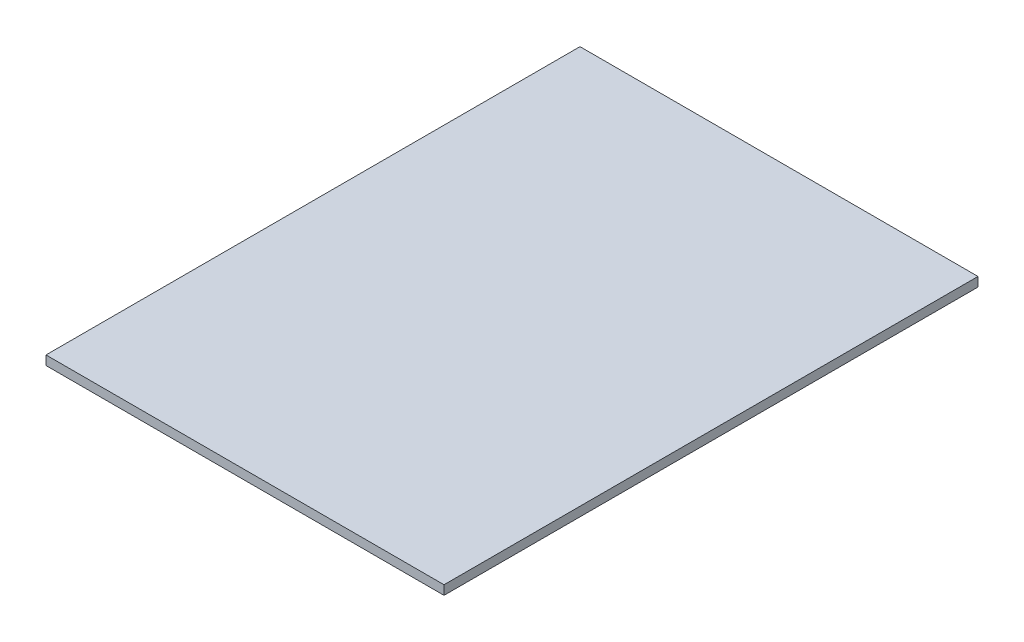
ISO-10303-21;
HEADER;
FILE_DESCRIPTION(('STEP AP214'),'2;1');
FILE_NAME('part.step','',(''),(''),'','','');
FILE_SCHEMA(('AUTOMOTIVE_DESIGN { 1 0 10303 214 1 1 1 1 }'));
ENDSEC;
DATA;
#1=APPLICATION_CONTEXT('core data for automotive mechanical design processes');
#2=APPLICATION_PROTOCOL_DEFINITION('international standard','automotive_design',2000,#1);
#3=PRODUCT_CONTEXT('',#1,'mechanical');
#4=PRODUCT('Part','Part','',(#3));
#5=PRODUCT_RELATED_PRODUCT_CATEGORY('part','',(#4));
#6=PRODUCT_DEFINITION_FORMATION('','',#4);
#7=PRODUCT_DEFINITION_CONTEXT('part definition',#1,'design');
#8=PRODUCT_DEFINITION('design','',#6,#7);
#9=PRODUCT_DEFINITION_SHAPE('','',#8);
#10=(LENGTH_UNIT() NAMED_UNIT(*) SI_UNIT(.MILLI.,.METRE.));
#11=(NAMED_UNIT(*) PLANE_ANGLE_UNIT() SI_UNIT($,.RADIAN.));
#12=(NAMED_UNIT(*) SI_UNIT($,.STERADIAN.) SOLID_ANGLE_UNIT());
#13=UNCERTAINTY_MEASURE_WITH_UNIT(LENGTH_MEASURE(1.E-05),#10,'distance_accuracy_value','');
#14=(GEOMETRIC_REPRESENTATION_CONTEXT(3) GLOBAL_UNCERTAINTY_ASSIGNED_CONTEXT((#13)) GLOBAL_UNIT_ASSIGNED_CONTEXT((#10,
#11,#12)) REPRESENTATION_CONTEXT('',''));
#15=CARTESIAN_POINT('',(0.,0.,0.));
#16=DIRECTION('',(0.,0.,1.));
#17=DIRECTION('',(1.,0.,0.));
#18=AXIS2_PLACEMENT_3D('',#15,#16,#17);
#19=CARTESIAN_POINT('',(0.,2.032,0.));
#20=DIRECTION('',(1.,0.,0.));
#21=DIRECTION('',(0.,0.,-1.));
#22=AXIS2_PLACEMENT_3D('',#19,#20,#21);
#23=PLANE('',#22);
#24=DIRECTION('',(0.,0.,1.));
#25=VECTOR('',#24,1.);
#26=CARTESIAN_POINT('',(0.,0.,0.));
#27=LINE('',#26,#25);
#28=CARTESIAN_POINT('',(0.,0.,-117.828));
#29=VERTEX_POINT('',#28);
#30=CARTESIAN_POINT('',(0.,0.,0.));
#31=VERTEX_POINT('',#30);
#32=EDGE_CURVE('E96',#29,#31,#27,.T.);
#33=ORIENTED_EDGE('',*,*,#32,.T.);
#34=DIRECTION('',(0.,-1.,0.));
#35=VECTOR('',#34,1.);
#36=CARTESIAN_POINT('',(0.,2.032,0.));
#37=LINE('',#36,#35);
#38=CARTESIAN_POINT('',(0.,2.032,0.));
#39=VERTEX_POINT('',#38);
#40=EDGE_CURVE('E11',#39,#31,#37,.T.);
#41=ORIENTED_EDGE('',*,*,#40,.F.);
#42=DIRECTION('',(0.,0.,1.));
#43=VECTOR('',#42,1.);
#44=CARTESIAN_POINT('',(0.,2.032,0.));
#45=LINE('',#44,#43);
#46=CARTESIAN_POINT('',(0.,2.032,-117.828));
#47=VERTEX_POINT('',#46);
#48=EDGE_CURVE('E84',#47,#39,#45,.T.);
#49=ORIENTED_EDGE('',*,*,#48,.F.);
#50=DIRECTION('',(0.,-1.,0.));
#51=VECTOR('',#50,1.);
#52=CARTESIAN_POINT('',(0.,2.032,-117.828));
#53=LINE('',#52,#51);
#54=EDGE_CURVE('E92',#47,#29,#53,.T.);
#55=ORIENTED_EDGE('',*,*,#54,.T.);
#56=EDGE_LOOP('',(#33,#41,#49,#55));
#57=FACE_BOUND('',#56,.T.);
#58=ADVANCED_FACE('F33',(#57),#23,.F.);
#59=CARTESIAN_POINT('',(0.,2.032,0.));
#60=DIRECTION('',(0.,0.,-1.));
#61=DIRECTION('',(-1.,0.,0.));
#62=AXIS2_PLACEMENT_3D('',#59,#60,#61);
#63=PLANE('',#62);
#64=DIRECTION('',(1.,0.,0.));
#65=VECTOR('',#64,1.);
#66=CARTESIAN_POINT('',(0.,0.,0.));
#67=LINE('',#66,#65);
#68=CARTESIAN_POINT('',(87.828,0.,0.));
#69=VERTEX_POINT('',#68);
#70=EDGE_CURVE('E88',#31,#69,#67,.T.);
#71=ORIENTED_EDGE('',*,*,#70,.T.);
#72=DIRECTION('',(0.,-1.,0.));
#73=VECTOR('',#72,1.);
#74=CARTESIAN_POINT('',(87.828,2.032,0.));
#75=LINE('',#74,#73);
#76=CARTESIAN_POINT('',(87.828,2.032,0.));
#77=VERTEX_POINT('',#76);
#78=EDGE_CURVE('E41',#77,#69,#75,.T.);
#79=ORIENTED_EDGE('',*,*,#78,.F.);
#80=DIRECTION('',(1.,0.,0.));
#81=VECTOR('',#80,1.);
#82=CARTESIAN_POINT('',(0.,2.032,0.));
#83=LINE('',#82,#81);
#84=EDGE_CURVE('E79',#39,#77,#83,.T.);
#85=ORIENTED_EDGE('',*,*,#84,.F.);
#86=ORIENTED_EDGE('',*,*,#40,.T.);
#87=EDGE_LOOP('',(#71,#79,#85,#86));
#88=FACE_BOUND('',#87,.T.);
#89=ADVANCED_FACE('F87',(#88),#63,.F.);
#90=CARTESIAN_POINT('',(87.828,2.032,0.));
#91=DIRECTION('',(-1.,0.,0.));
#92=DIRECTION('',(0.,0.,1.));
#93=AXIS2_PLACEMENT_3D('',#90,#91,#92);
#94=PLANE('',#93);
#95=DIRECTION('',(0.,0.,-1.));
#96=VECTOR('',#95,1.);
#97=CARTESIAN_POINT('',(87.828,0.,0.));
#98=LINE('',#97,#96);
#99=CARTESIAN_POINT('',(87.828,0.,-117.828));
#100=VERTEX_POINT('',#99);
#101=EDGE_CURVE('E66',#69,#100,#98,.T.);
#102=ORIENTED_EDGE('',*,*,#101,.T.);
#103=DIRECTION('',(0.,-1.,0.));
#104=VECTOR('',#103,1.);
#105=CARTESIAN_POINT('',(87.828,2.032,-117.828));
#106=LINE('',#105,#104);
#107=CARTESIAN_POINT('',(87.828,2.032,-117.828));
#108=VERTEX_POINT('',#107);
#109=EDGE_CURVE('E89',#108,#100,#106,.T.);
#110=ORIENTED_EDGE('',*,*,#109,.F.);
#111=DIRECTION('',(0.,0.,-1.));
#112=VECTOR('',#111,1.);
#113=CARTESIAN_POINT('',(87.828,2.032,0.));
#114=LINE('',#113,#112);
#115=EDGE_CURVE('E82',#77,#108,#114,.T.);
#116=ORIENTED_EDGE('',*,*,#115,.F.);
#117=ORIENTED_EDGE('',*,*,#78,.T.);
#118=EDGE_LOOP('',(#102,#110,#116,#117));
#119=FACE_BOUND('',#118,.T.);
#120=ADVANCED_FACE('F90',(#119),#94,.F.);
#121=CARTESIAN_POINT('',(0.,2.032,-117.828));
#122=DIRECTION('',(0.,0.,1.));
#123=DIRECTION('',(1.,0.,0.));
#124=AXIS2_PLACEMENT_3D('',#121,#122,#123);
#125=PLANE('',#124);
#126=DIRECTION('',(-1.,0.,0.));
#127=VECTOR('',#126,1.);
#128=CARTESIAN_POINT('',(0.,0.,-117.828));
#129=LINE('',#128,#127);
#130=EDGE_CURVE('E72',#100,#29,#129,.T.);
#131=ORIENTED_EDGE('',*,*,#130,.T.);
#132=ORIENTED_EDGE('',*,*,#54,.F.);
#133=DIRECTION('',(-1.,0.,0.));
#134=VECTOR('',#133,1.);
#135=CARTESIAN_POINT('',(0.,2.032,-117.828));
#136=LINE('',#135,#134);
#137=EDGE_CURVE('E49',#108,#47,#136,.T.);
#138=ORIENTED_EDGE('',*,*,#137,.F.);
#139=ORIENTED_EDGE('',*,*,#109,.T.);
#140=EDGE_LOOP('',(#131,#132,#138,#139));
#141=FACE_BOUND('',#140,.T.);
#142=ADVANCED_FACE('F103',(#141),#125,.F.);
#143=CARTESIAN_POINT('',(0.,2.032,0.));
#144=DIRECTION('',(0.,-1.,0.));
#145=DIRECTION('',(0.,0.,-1.));
#146=AXIS2_PLACEMENT_3D('',#143,#144,#145);
#147=PLANE('',#146);
#148=ORIENTED_EDGE('',*,*,#48,.T.);
#149=ORIENTED_EDGE('',*,*,#84,.T.);
#150=ORIENTED_EDGE('',*,*,#115,.T.);
#151=ORIENTED_EDGE('',*,*,#137,.T.);
#152=EDGE_LOOP('',(#148,#149,#150,#151));
#153=FACE_BOUND('',#152,.T.);
#154=ADVANCED_FACE('F80',(#153),#147,.F.);
#155=CARTESIAN_POINT('',(0.,0.,0.));
#156=DIRECTION('',(0.,-1.,0.));
#157=DIRECTION('',(0.,0.,-1.));
#158=AXIS2_PLACEMENT_3D('',#155,#156,#157);
#159=PLANE('',#158);
#160=ORIENTED_EDGE('',*,*,#32,.F.);
#161=ORIENTED_EDGE('',*,*,#130,.F.);
#162=ORIENTED_EDGE('',*,*,#101,.F.);
#163=ORIENTED_EDGE('',*,*,#70,.F.);
#164=EDGE_LOOP('',(#160,#161,#162,#163));
#165=FACE_BOUND('',#164,.T.);
#166=ADVANCED_FACE('F106',(#165),#159,.T.);
#167=CLOSED_SHELL('',(#58,#89,#120,#142,#154,#166));
#168=MANIFOLD_SOLID_BREP('B2',#167);
#169=ADVANCED_BREP_SHAPE_REPRESENTATION('',(#18,#168),#14);
#170=SHAPE_DEFINITION_REPRESENTATION(#9,#169);
ENDSEC;
END-ISO-10303-21;
